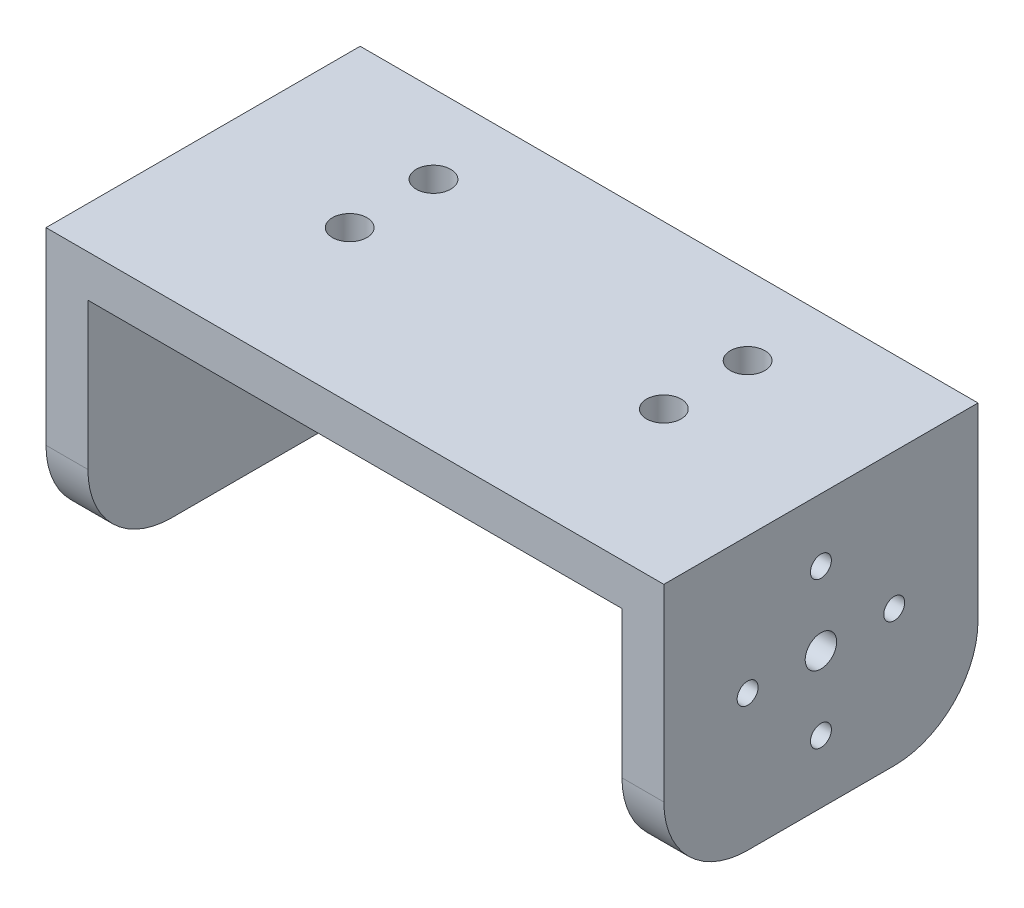
ISO-10303-21;
HEADER;
FILE_DESCRIPTION(('STEP AP214'),'2;1');
FILE_NAME('part.step','',(''),(''),'','','');
FILE_SCHEMA(('AUTOMOTIVE_DESIGN { 1 0 10303 214 1 1 1 1 }'));
ENDSEC;
DATA;
#1=APPLICATION_CONTEXT('core data for automotive mechanical design processes');
#2=APPLICATION_PROTOCOL_DEFINITION('international standard','automotive_design',2000,#1);
#3=PRODUCT_CONTEXT('',#1,'mechanical');
#4=PRODUCT('Part','Part','',(#3));
#5=PRODUCT_RELATED_PRODUCT_CATEGORY('part','',(#4));
#6=PRODUCT_DEFINITION_FORMATION('','',#4);
#7=PRODUCT_DEFINITION_CONTEXT('part definition',#1,'design');
#8=PRODUCT_DEFINITION('design','',#6,#7);
#9=PRODUCT_DEFINITION_SHAPE('','',#8);
#10=(LENGTH_UNIT() NAMED_UNIT(*) SI_UNIT(.MILLI.,.METRE.));
#11=(NAMED_UNIT(*) PLANE_ANGLE_UNIT() SI_UNIT($,.RADIAN.));
#12=(NAMED_UNIT(*) SI_UNIT($,.STERADIAN.) SOLID_ANGLE_UNIT());
#13=UNCERTAINTY_MEASURE_WITH_UNIT(LENGTH_MEASURE(1.E-05),#10,'distance_accuracy_value','');
#14=(GEOMETRIC_REPRESENTATION_CONTEXT(3) GLOBAL_UNCERTAINTY_ASSIGNED_CONTEXT((#13)) GLOBAL_UNIT_ASSIGNED_CONTEXT((#10,
#11,#12)) REPRESENTATION_CONTEXT('',''));
#15=CARTESIAN_POINT('',(0.,0.,0.));
#16=DIRECTION('',(0.,0.,1.));
#17=DIRECTION('',(1.,0.,0.));
#18=AXIS2_PLACEMENT_3D('',#15,#16,#17);
#19=CARTESIAN_POINT('',(29.5,0.,30.));
#20=DIRECTION('',(-1.,0.,0.));
#21=DIRECTION('',(0.,0.,1.));
#22=AXIS2_PLACEMENT_3D('',#19,#20,#21);
#23=PLANE('',#22);
#24=CARTESIAN_POINT('',(29.5,-13.,15.));
#25=DIRECTION('',(1.,0.,0.));
#26=DIRECTION('',(0.,0.,-1.));
#27=AXIS2_PLACEMENT_3D('',#24,#25,#26);
#28=CIRCLE('',#27,1.5);
#29=CARTESIAN_POINT('',(29.5,-13.,13.5));
#30=VERTEX_POINT('',#29);
#31=EDGE_CURVE('E513',#30,#30,#28,.T.);
#32=ORIENTED_EDGE('',*,*,#31,.F.);
#33=EDGE_LOOP('',(#32));
#34=FACE_BOUND('',#33,.T.);
#35=CARTESIAN_POINT('',(29.5,-13.,8.));
#36=DIRECTION('',(1.,0.,0.));
#37=DIRECTION('',(0.,0.,-1.));
#38=AXIS2_PLACEMENT_3D('',#35,#36,#37);
#39=CIRCLE('',#38,1.);
#40=CARTESIAN_POINT('',(29.5,-13.,7.));
#41=VERTEX_POINT('',#40);
#42=EDGE_CURVE('E212',#41,#41,#39,.T.);
#43=ORIENTED_EDGE('',*,*,#42,.F.);
#44=EDGE_LOOP('',(#43));
#45=FACE_BOUND('',#44,.T.);
#46=CARTESIAN_POINT('',(29.5,-20.,15.));
#47=DIRECTION('',(1.,0.,0.));
#48=DIRECTION('',(0.,0.,-1.));
#49=AXIS2_PLACEMENT_3D('',#46,#47,#48);
#50=CIRCLE('',#49,1.);
#51=CARTESIAN_POINT('',(29.5,-20.,14.));
#52=VERTEX_POINT('',#51);
#53=EDGE_CURVE('E521',#52,#52,#50,.T.);
#54=ORIENTED_EDGE('',*,*,#53,.F.);
#55=EDGE_LOOP('',(#54));
#56=FACE_BOUND('',#55,.T.);
#57=CARTESIAN_POINT('',(29.5,-13.,22.));
#58=DIRECTION('',(1.,0.,0.));
#59=DIRECTION('',(0.,0.,-1.));
#60=AXIS2_PLACEMENT_3D('',#57,#58,#59);
#61=CIRCLE('',#60,1.);
#62=CARTESIAN_POINT('',(29.5,-13.,21.));
#63=VERTEX_POINT('',#62);
#64=EDGE_CURVE('E516',#63,#63,#61,.T.);
#65=ORIENTED_EDGE('',*,*,#64,.F.);
#66=EDGE_LOOP('',(#65));
#67=FACE_BOUND('',#66,.T.);
#68=CARTESIAN_POINT('',(29.5,-6.00000000000001,15.));
#69=DIRECTION('',(1.,0.,0.));
#70=DIRECTION('',(0.,0.,-1.));
#71=AXIS2_PLACEMENT_3D('',#68,#69,#70);
#72=CIRCLE('',#71,1.);
#73=CARTESIAN_POINT('',(29.5,-6.00000000000001,14.));
#74=VERTEX_POINT('',#73);
#75=EDGE_CURVE('E227',#74,#74,#72,.T.);
#76=ORIENTED_EDGE('',*,*,#75,.F.);
#77=EDGE_LOOP('',(#76));
#78=FACE_BOUND('',#77,.T.);
#79=DIRECTION('',(0.,0.,-1.));
#80=VECTOR('',#79,1.);
#81=CARTESIAN_POINT('',(29.5,-26.,30.));
#82=LINE('',#81,#80);
#83=CARTESIAN_POINT('',(29.5,-26.,22.));
#84=VERTEX_POINT('',#83);
#85=CARTESIAN_POINT('',(29.5,-26.,8.));
#86=VERTEX_POINT('',#85);
#87=EDGE_CURVE('E246',#84,#86,#82,.T.);
#88=ORIENTED_EDGE('',*,*,#87,.T.);
#89=CARTESIAN_POINT('',(29.5,-18.,8.));
#90=DIRECTION('',(-1.,0.,0.));
#91=DIRECTION('',(0.,0.,1.));
#92=AXIS2_PLACEMENT_3D('',#89,#90,#91);
#93=CIRCLE('',#92,8.);
#94=CARTESIAN_POINT('',(29.5,-18.,0.));
#95=VERTEX_POINT('',#94);
#96=EDGE_CURVE('E187',#86,#95,#93,.F.);
#97=ORIENTED_EDGE('',*,*,#96,.T.);
#98=DIRECTION('',(0.,1.,0.));
#99=VECTOR('',#98,1.);
#100=CARTESIAN_POINT('',(29.5,0.,0.));
#101=LINE('',#100,#99);
#102=CARTESIAN_POINT('',(29.5,0.,0.));
#103=VERTEX_POINT('',#102);
#104=EDGE_CURVE('E153',#95,#103,#101,.T.);
#105=ORIENTED_EDGE('',*,*,#104,.T.);
#106=DIRECTION('',(0.,0.,-1.));
#107=VECTOR('',#106,1.);
#108=CARTESIAN_POINT('',(29.5,0.,30.));
#109=LINE('',#108,#107);
#110=CARTESIAN_POINT('',(29.5,0.,30.));
#111=VERTEX_POINT('',#110);
#112=EDGE_CURVE('E145',#111,#103,#109,.T.);
#113=ORIENTED_EDGE('',*,*,#112,.F.);
#114=DIRECTION('',(0.,1.,0.));
#115=VECTOR('',#114,1.);
#116=CARTESIAN_POINT('',(29.5,0.,30.));
#117=LINE('',#116,#115);
#118=CARTESIAN_POINT('',(29.5,-18.,30.));
#119=VERTEX_POINT('',#118);
#120=EDGE_CURVE('E129',#119,#111,#117,.T.);
#121=ORIENTED_EDGE('',*,*,#120,.F.);
#122=CARTESIAN_POINT('',(29.5,-18.,22.));
#123=DIRECTION('',(-1.,0.,0.));
#124=DIRECTION('',(0.,0.,1.));
#125=AXIS2_PLACEMENT_3D('',#122,#123,#124);
#126=CIRCLE('',#125,8.);
#127=EDGE_CURVE('E185',#119,#84,#126,.F.);
#128=ORIENTED_EDGE('',*,*,#127,.T.);
#129=EDGE_LOOP('',(#88,#97,#105,#113,#121,#128));
#130=FACE_BOUND('',#129,.T.);
#131=ADVANCED_FACE('F38',(#34,#45,#56,#67,#78,#130),#23,.F.);
#132=CARTESIAN_POINT('',(0.,0.,30.));
#133=DIRECTION('',(0.,-1.,0.));
#134=DIRECTION('',(1.,0.,0.));
#135=AXIS2_PLACEMENT_3D('',#132,#133,#134);
#136=PLANE('',#135);
#137=CARTESIAN_POINT('',(15.,0.,15.5));
#138=DIRECTION('',(0.,1.,0.));
#139=DIRECTION('',(1.,0.,0.));
#140=AXIS2_PLACEMENT_3D('',#137,#138,#139);
#141=CIRCLE('',#140,1.65000000000001);
#142=CARTESIAN_POINT('',(16.65,0.,15.5));
#143=VERTEX_POINT('',#142);
#144=EDGE_CURVE('E206',#143,#143,#141,.T.);
#145=ORIENTED_EDGE('',*,*,#144,.F.);
#146=EDGE_LOOP('',(#145));
#147=FACE_BOUND('',#146,.T.);
#148=CARTESIAN_POINT('',(-15.,0.,15.5));
#149=DIRECTION('',(0.,1.,0.));
#150=DIRECTION('',(1.,0.,0.));
#151=AXIS2_PLACEMENT_3D('',#148,#149,#150);
#152=CIRCLE('',#151,1.65);
#153=CARTESIAN_POINT('',(-13.35,0.,15.5));
#154=VERTEX_POINT('',#153);
#155=EDGE_CURVE('E232',#154,#154,#152,.T.);
#156=ORIENTED_EDGE('',*,*,#155,.F.);
#157=EDGE_LOOP('',(#156));
#158=FACE_BOUND('',#157,.T.);
#159=CARTESIAN_POINT('',(-15.,0.,7.5));
#160=DIRECTION('',(0.,1.,0.));
#161=DIRECTION('',(-1.,0.,0.));
#162=AXIS2_PLACEMENT_3D('',#159,#160,#161);
#163=CIRCLE('',#162,1.65);
#164=CARTESIAN_POINT('',(-16.65,0.,7.5));
#165=VERTEX_POINT('',#164);
#166=EDGE_CURVE('E229',#165,#165,#163,.T.);
#167=ORIENTED_EDGE('',*,*,#166,.F.);
#168=EDGE_LOOP('',(#167));
#169=FACE_BOUND('',#168,.T.);
#170=CARTESIAN_POINT('',(15.,0.,7.5));
#171=DIRECTION('',(0.,1.,0.));
#172=DIRECTION('',(-1.,0.,0.));
#173=AXIS2_PLACEMENT_3D('',#170,#171,#172);
#174=CIRCLE('',#173,1.65000000000001);
#175=CARTESIAN_POINT('',(13.35,0.,7.5));
#176=VERTEX_POINT('',#175);
#177=EDGE_CURVE('E194',#176,#176,#174,.T.);
#178=ORIENTED_EDGE('',*,*,#177,.F.);
#179=EDGE_LOOP('',(#178));
#180=FACE_BOUND('',#179,.T.);
#181=DIRECTION('',(-1.,0.,0.));
#182=VECTOR('',#181,1.);
#183=CARTESIAN_POINT('',(0.,0.,0.));
#184=LINE('',#183,#182);
#185=CARTESIAN_POINT('',(-29.5,0.,0.));
#186=VERTEX_POINT('',#185);
#187=EDGE_CURVE('E248',#103,#186,#184,.T.);
#188=ORIENTED_EDGE('',*,*,#187,.T.);
#189=DIRECTION('',(0.,0.,-1.));
#190=VECTOR('',#189,1.);
#191=CARTESIAN_POINT('',(-29.5,0.,30.));
#192=LINE('',#191,#190);
#193=CARTESIAN_POINT('',(-29.5,0.,30.));
#194=VERTEX_POINT('',#193);
#195=EDGE_CURVE('E147',#194,#186,#192,.T.);
#196=ORIENTED_EDGE('',*,*,#195,.F.);
#197=DIRECTION('',(-1.,0.,0.));
#198=VECTOR('',#197,1.);
#199=CARTESIAN_POINT('',(0.,0.,30.));
#200=LINE('',#199,#198);
#201=EDGE_CURVE('E133',#111,#194,#200,.T.);
#202=ORIENTED_EDGE('',*,*,#201,.F.);
#203=ORIENTED_EDGE('',*,*,#112,.T.);
#204=EDGE_LOOP('',(#188,#196,#202,#203));
#205=FACE_BOUND('',#204,.T.);
#206=ADVANCED_FACE('F144',(#147,#158,#169,#180,#205),#136,.F.);
#207=CARTESIAN_POINT('',(-29.5,0.,30.));
#208=DIRECTION('',(1.,0.,0.));
#209=DIRECTION('',(0.,1.,0.));
#210=AXIS2_PLACEMENT_3D('',#207,#208,#209);
#211=PLANE('',#210);
#212=CARTESIAN_POINT('',(-29.5,-13.,15.));
#213=DIRECTION('',(-1.,0.,0.));
#214=DIRECTION('',(0.,-1.,0.));
#215=AXIS2_PLACEMENT_3D('',#212,#213,#214);
#216=CIRCLE('',#215,1.65);
#217=CARTESIAN_POINT('',(-29.5,-14.65,15.));
#218=VERTEX_POINT('',#217);
#219=EDGE_CURVE('E207',#218,#218,#216,.T.);
#220=ORIENTED_EDGE('',*,*,#219,.F.);
#221=EDGE_LOOP('',(#220));
#222=FACE_BOUND('',#221,.T.);
#223=DIRECTION('',(0.,0.,-1.));
#224=VECTOR('',#223,1.);
#225=CARTESIAN_POINT('',(-29.5,-26.,30.));
#226=LINE('',#225,#224);
#227=CARTESIAN_POINT('',(-29.5,-26.,22.));
#228=VERTEX_POINT('',#227);
#229=CARTESIAN_POINT('',(-29.5,-26.,8.));
#230=VERTEX_POINT('',#229);
#231=EDGE_CURVE('E158',#228,#230,#226,.T.);
#232=ORIENTED_EDGE('',*,*,#231,.F.);
#233=CARTESIAN_POINT('',(-29.5,-18.,22.));
#234=DIRECTION('',(1.,0.,0.));
#235=DIRECTION('',(0.,1.,0.));
#236=AXIS2_PLACEMENT_3D('',#233,#234,#235);
#237=CIRCLE('',#236,8.);
#238=CARTESIAN_POINT('',(-29.5,-18.,30.));
#239=VERTEX_POINT('',#238);
#240=EDGE_CURVE('E175',#228,#239,#237,.F.);
#241=ORIENTED_EDGE('',*,*,#240,.T.);
#242=DIRECTION('',(0.,-1.,0.));
#243=VECTOR('',#242,1.);
#244=CARTESIAN_POINT('',(-29.5,0.,30.));
#245=LINE('',#244,#243);
#246=EDGE_CURVE('E149',#194,#239,#245,.T.);
#247=ORIENTED_EDGE('',*,*,#246,.F.);
#248=ORIENTED_EDGE('',*,*,#195,.T.);
#249=DIRECTION('',(0.,-1.,0.));
#250=VECTOR('',#249,1.);
#251=CARTESIAN_POINT('',(-29.5,0.,0.));
#252=LINE('',#251,#250);
#253=CARTESIAN_POINT('',(-29.5,-18.,0.));
#254=VERTEX_POINT('',#253);
#255=EDGE_CURVE('E250',#186,#254,#252,.T.);
#256=ORIENTED_EDGE('',*,*,#255,.T.);
#257=CARTESIAN_POINT('',(-29.5,-18.,8.));
#258=DIRECTION('',(1.,0.,0.));
#259=DIRECTION('',(0.,1.,0.));
#260=AXIS2_PLACEMENT_3D('',#257,#258,#259);
#261=CIRCLE('',#260,8.);
#262=EDGE_CURVE('E173',#254,#230,#261,.F.);
#263=ORIENTED_EDGE('',*,*,#262,.T.);
#264=EDGE_LOOP('',(#232,#241,#247,#248,#256,#263));
#265=FACE_BOUND('',#264,.T.);
#266=ADVANCED_FACE('F299',(#222,#265),#211,.F.);
#267=CARTESIAN_POINT('',(-25.5,-26.,30.));
#268=DIRECTION('',(0.,1.,0.));
#269=DIRECTION('',(0.,0.,1.));
#270=AXIS2_PLACEMENT_3D('',#267,#268,#269);
#271=PLANE('',#270);
#272=DIRECTION('',(0.,0.,-1.));
#273=VECTOR('',#272,1.);
#274=CARTESIAN_POINT('',(-25.5,-26.,30.));
#275=LINE('',#274,#273);
#276=CARTESIAN_POINT('',(-25.5,-26.,22.));
#277=VERTEX_POINT('',#276);
#278=CARTESIAN_POINT('',(-25.5,-26.,8.));
#279=VERTEX_POINT('',#278);
#280=EDGE_CURVE('E267',#277,#279,#275,.T.);
#281=ORIENTED_EDGE('',*,*,#280,.F.);
#282=DIRECTION('',(1.,0.,0.));
#283=VECTOR('',#282,1.);
#284=CARTESIAN_POINT('',(-29.5,-26.,22.));
#285=LINE('',#284,#283);
#286=EDGE_CURVE('E171',#277,#228,#285,.F.);
#287=ORIENTED_EDGE('',*,*,#286,.T.);
#288=ORIENTED_EDGE('',*,*,#231,.T.);
#289=DIRECTION('',(1.,0.,0.));
#290=VECTOR('',#289,1.);
#291=CARTESIAN_POINT('',(-25.5,-26.,8.));
#292=LINE('',#291,#290);
#293=EDGE_CURVE('E168',#230,#279,#292,.T.);
#294=ORIENTED_EDGE('',*,*,#293,.T.);
#295=EDGE_LOOP('',(#281,#287,#288,#294));
#296=FACE_BOUND('',#295,.T.);
#297=ADVANCED_FACE('F274',(#296),#271,.F.);
#298=CARTESIAN_POINT('',(-25.5,-4.00000000000001,30.));
#299=DIRECTION('',(-1.,0.,0.));
#300=DIRECTION('',(0.,0.,1.));
#301=AXIS2_PLACEMENT_3D('',#298,#299,#300);
#302=PLANE('',#301);
#303=CARTESIAN_POINT('',(-25.5,-13.,15.));
#304=DIRECTION('',(-1.,0.,0.));
#305=DIRECTION('',(0.,0.,1.));
#306=AXIS2_PLACEMENT_3D('',#303,#304,#305);
#307=CIRCLE('',#306,1.65);
#308=CARTESIAN_POINT('',(-25.5,-13.,16.65));
#309=VERTEX_POINT('',#308);
#310=EDGE_CURVE('E203',#309,#309,#307,.T.);
#311=ORIENTED_EDGE('',*,*,#310,.T.);
#312=EDGE_LOOP('',(#311));
#313=FACE_BOUND('',#312,.T.);
#314=DIRECTION('',(0.,1.,0.));
#315=VECTOR('',#314,1.);
#316=CARTESIAN_POINT('',(-25.5,-4.00000000000001,30.));
#317=LINE('',#316,#315);
#318=CARTESIAN_POINT('',(-25.5,-18.,30.));
#319=VERTEX_POINT('',#318);
#320=CARTESIAN_POINT('',(-25.5,-4.00000000000001,30.));
#321=VERTEX_POINT('',#320);
#322=EDGE_CURVE('E240',#319,#321,#317,.T.);
#323=ORIENTED_EDGE('',*,*,#322,.F.);
#324=CARTESIAN_POINT('',(-25.5,-18.,22.));
#325=DIRECTION('',(-1.,0.,0.));
#326=DIRECTION('',(0.,0.,1.));
#327=AXIS2_PLACEMENT_3D('',#324,#325,#326);
#328=CIRCLE('',#327,8.);
#329=EDGE_CURVE('E166',#319,#277,#328,.F.);
#330=ORIENTED_EDGE('',*,*,#329,.T.);
#331=ORIENTED_EDGE('',*,*,#280,.T.);
#332=CARTESIAN_POINT('',(-25.5,-18.,8.));
#333=DIRECTION('',(-1.,0.,0.));
#334=DIRECTION('',(0.,0.,1.));
#335=AXIS2_PLACEMENT_3D('',#332,#333,#334);
#336=CIRCLE('',#335,8.);
#337=CARTESIAN_POINT('',(-25.5,-18.,0.));
#338=VERTEX_POINT('',#337);
#339=EDGE_CURVE('E164',#279,#338,#336,.F.);
#340=ORIENTED_EDGE('',*,*,#339,.T.);
#341=DIRECTION('',(0.,1.,0.));
#342=VECTOR('',#341,1.);
#343=CARTESIAN_POINT('',(-25.5,-4.00000000000001,0.));
#344=LINE('',#343,#342);
#345=CARTESIAN_POINT('',(-25.5,-4.00000000000001,0.));
#346=VERTEX_POINT('',#345);
#347=EDGE_CURVE('E253',#338,#346,#344,.T.);
#348=ORIENTED_EDGE('',*,*,#347,.T.);
#349=DIRECTION('',(0.,0.,-1.));
#350=VECTOR('',#349,1.);
#351=CARTESIAN_POINT('',(-25.5,-4.00000000000001,30.));
#352=LINE('',#351,#350);
#353=EDGE_CURVE('E264',#321,#346,#352,.T.);
#354=ORIENTED_EDGE('',*,*,#353,.F.);
#355=EDGE_LOOP('',(#323,#330,#331,#340,#348,#354));
#356=FACE_BOUND('',#355,.T.);
#357=ADVANCED_FACE('F285',(#313,#356),#302,.F.);
#358=CARTESIAN_POINT('',(0.,-4.,30.));
#359=DIRECTION('',(0.,1.,0.));
#360=DIRECTION('',(0.,0.,1.));
#361=AXIS2_PLACEMENT_3D('',#358,#359,#360);
#362=PLANE('',#361);
#363=CARTESIAN_POINT('',(15.,-4.,15.5));
#364=DIRECTION('',(0.,1.,0.));
#365=DIRECTION('',(0.,0.,1.));
#366=AXIS2_PLACEMENT_3D('',#363,#364,#365);
#367=CIRCLE('',#366,1.65000000000001);
#368=CARTESIAN_POINT('',(15.,-4.,17.15));
#369=VERTEX_POINT('',#368);
#370=EDGE_CURVE('E200',#369,#369,#367,.T.);
#371=ORIENTED_EDGE('',*,*,#370,.T.);
#372=EDGE_LOOP('',(#371));
#373=FACE_BOUND('',#372,.T.);
#374=CARTESIAN_POINT('',(-15.,-4.,15.5));
#375=DIRECTION('',(0.,1.,0.));
#376=DIRECTION('',(0.,0.,1.));
#377=AXIS2_PLACEMENT_3D('',#374,#375,#376);
#378=CIRCLE('',#377,1.65);
#379=CARTESIAN_POINT('',(-15.,-4.,17.15));
#380=VERTEX_POINT('',#379);
#381=EDGE_CURVE('E197',#380,#380,#378,.T.);
#382=ORIENTED_EDGE('',*,*,#381,.T.);
#383=EDGE_LOOP('',(#382));
#384=FACE_BOUND('',#383,.T.);
#385=CARTESIAN_POINT('',(-15.,-4.,7.5));
#386=DIRECTION('',(0.,1.,0.));
#387=DIRECTION('',(0.,0.,1.));
#388=AXIS2_PLACEMENT_3D('',#385,#386,#387);
#389=CIRCLE('',#388,1.65);
#390=CARTESIAN_POINT('',(-15.,-4.,9.15));
#391=VERTEX_POINT('',#390);
#392=EDGE_CURVE('E193',#391,#391,#389,.T.);
#393=ORIENTED_EDGE('',*,*,#392,.T.);
#394=EDGE_LOOP('',(#393));
#395=FACE_BOUND('',#394,.T.);
#396=CARTESIAN_POINT('',(15.,-4.,7.5));
#397=DIRECTION('',(0.,1.,0.));
#398=DIRECTION('',(0.,0.,1.));
#399=AXIS2_PLACEMENT_3D('',#396,#397,#398);
#400=CIRCLE('',#399,1.65000000000001);
#401=CARTESIAN_POINT('',(15.,-4.,9.15));
#402=VERTEX_POINT('',#401);
#403=EDGE_CURVE('E190',#402,#402,#400,.T.);
#404=ORIENTED_EDGE('',*,*,#403,.T.);
#405=EDGE_LOOP('',(#404));
#406=FACE_BOUND('',#405,.T.);
#407=DIRECTION('',(1.,0.,0.));
#408=VECTOR('',#407,1.);
#409=CARTESIAN_POINT('',(0.,-4.,0.));
#410=LINE('',#409,#408);
#411=CARTESIAN_POINT('',(25.5,-4.,0.));
#412=VERTEX_POINT('',#411);
#413=EDGE_CURVE('E255',#346,#412,#410,.T.);
#414=ORIENTED_EDGE('',*,*,#413,.T.);
#415=DIRECTION('',(0.,0.,-1.));
#416=VECTOR('',#415,1.);
#417=CARTESIAN_POINT('',(25.5,-4.,30.));
#418=LINE('',#417,#416);
#419=CARTESIAN_POINT('',(25.5,-4.,30.));
#420=VERTEX_POINT('',#419);
#421=EDGE_CURVE('E261',#420,#412,#418,.T.);
#422=ORIENTED_EDGE('',*,*,#421,.F.);
#423=DIRECTION('',(1.,0.,0.));
#424=VECTOR('',#423,1.);
#425=CARTESIAN_POINT('',(0.,-4.,30.));
#426=LINE('',#425,#424);
#427=EDGE_CURVE('E242',#321,#420,#426,.T.);
#428=ORIENTED_EDGE('',*,*,#427,.F.);
#429=ORIENTED_EDGE('',*,*,#353,.T.);
#430=EDGE_LOOP('',(#414,#422,#428,#429));
#431=FACE_BOUND('',#430,.T.);
#432=ADVANCED_FACE('F295',(#373,#384,#395,#406,#431),#362,.F.);
#433=CARTESIAN_POINT('',(25.5,-4.,30.));
#434=DIRECTION('',(1.,0.,0.));
#435=DIRECTION('',(0.,1.,0.));
#436=AXIS2_PLACEMENT_3D('',#433,#434,#435);
#437=PLANE('',#436);
#438=CARTESIAN_POINT('',(25.5,-13.,15.));
#439=DIRECTION('',(1.,0.,0.));
#440=DIRECTION('',(0.,1.,0.));
#441=AXIS2_PLACEMENT_3D('',#438,#439,#440);
#442=CIRCLE('',#441,1.5);
#443=CARTESIAN_POINT('',(25.5,-11.5,15.));
#444=VERTEX_POINT('',#443);
#445=EDGE_CURVE('E42',#444,#444,#442,.T.);
#446=ORIENTED_EDGE('',*,*,#445,.T.);
#447=EDGE_LOOP('',(#446));
#448=FACE_BOUND('',#447,.T.);
#449=CARTESIAN_POINT('',(25.5,-13.,8.));
#450=DIRECTION('',(1.,0.,0.));
#451=DIRECTION('',(0.,1.,0.));
#452=AXIS2_PLACEMENT_3D('',#449,#450,#451);
#453=CIRCLE('',#452,1.);
#454=CARTESIAN_POINT('',(25.5,-12.,8.));
#455=VERTEX_POINT('',#454);
#456=EDGE_CURVE('E217',#455,#455,#453,.T.);
#457=ORIENTED_EDGE('',*,*,#456,.T.);
#458=EDGE_LOOP('',(#457));
#459=FACE_BOUND('',#458,.T.);
#460=CARTESIAN_POINT('',(25.5,-20.,15.));
#461=DIRECTION('',(1.,0.,0.));
#462=DIRECTION('',(0.,1.,0.));
#463=AXIS2_PLACEMENT_3D('',#460,#461,#462);
#464=CIRCLE('',#463,1.);
#465=CARTESIAN_POINT('',(25.5,-19.,15.));
#466=VERTEX_POINT('',#465);
#467=EDGE_CURVE('E215',#466,#466,#464,.T.);
#468=ORIENTED_EDGE('',*,*,#467,.T.);
#469=EDGE_LOOP('',(#468));
#470=FACE_BOUND('',#469,.T.);
#471=CARTESIAN_POINT('',(25.5,-13.,22.));
#472=DIRECTION('',(1.,0.,0.));
#473=DIRECTION('',(0.,1.,0.));
#474=AXIS2_PLACEMENT_3D('',#471,#472,#473);
#475=CIRCLE('',#474,1.);
#476=CARTESIAN_POINT('',(25.5,-12.,22.));
#477=VERTEX_POINT('',#476);
#478=EDGE_CURVE('E211',#477,#477,#475,.T.);
#479=ORIENTED_EDGE('',*,*,#478,.T.);
#480=EDGE_LOOP('',(#479));
#481=FACE_BOUND('',#480,.T.);
#482=CARTESIAN_POINT('',(25.5,-6.00000000000001,15.));
#483=DIRECTION('',(1.,0.,0.));
#484=DIRECTION('',(0.,1.,0.));
#485=AXIS2_PLACEMENT_3D('',#482,#483,#484);
#486=CIRCLE('',#485,1.);
#487=CARTESIAN_POINT('',(25.5,-5.,15.));
#488=VERTEX_POINT('',#487);
#489=EDGE_CURVE('E208',#488,#488,#486,.T.);
#490=ORIENTED_EDGE('',*,*,#489,.T.);
#491=EDGE_LOOP('',(#490));
#492=FACE_BOUND('',#491,.T.);
#493=DIRECTION('',(0.,-1.,0.));
#494=VECTOR('',#493,1.);
#495=CARTESIAN_POINT('',(25.5,-4.,0.));
#496=LINE('',#495,#494);
#497=CARTESIAN_POINT('',(25.5,-18.,0.));
#498=VERTEX_POINT('',#497);
#499=EDGE_CURVE('E140',#412,#498,#496,.T.);
#500=ORIENTED_EDGE('',*,*,#499,.T.);
#501=CARTESIAN_POINT('',(25.5,-18.,8.));
#502=DIRECTION('',(1.,0.,0.));
#503=DIRECTION('',(0.,1.,0.));
#504=AXIS2_PLACEMENT_3D('',#501,#502,#503);
#505=CIRCLE('',#504,8.);
#506=CARTESIAN_POINT('',(25.5,-26.,8.));
#507=VERTEX_POINT('',#506);
#508=EDGE_CURVE('E11',#498,#507,#505,.F.);
#509=ORIENTED_EDGE('',*,*,#508,.T.);
#510=DIRECTION('',(0.,0.,-1.));
#511=VECTOR('',#510,1.);
#512=CARTESIAN_POINT('',(25.5,-26.,30.));
#513=LINE('',#512,#511);
#514=CARTESIAN_POINT('',(25.5,-26.,22.));
#515=VERTEX_POINT('',#514);
#516=EDGE_CURVE('E259',#515,#507,#513,.T.);
#517=ORIENTED_EDGE('',*,*,#516,.F.);
#518=CARTESIAN_POINT('',(25.5,-18.,22.));
#519=DIRECTION('',(1.,0.,0.));
#520=DIRECTION('',(0.,1.,0.));
#521=AXIS2_PLACEMENT_3D('',#518,#519,#520);
#522=CIRCLE('',#521,8.);
#523=CARTESIAN_POINT('',(25.5,-18.,30.));
#524=VERTEX_POINT('',#523);
#525=EDGE_CURVE('E47',#515,#524,#522,.F.);
#526=ORIENTED_EDGE('',*,*,#525,.T.);
#527=DIRECTION('',(0.,-1.,0.));
#528=VECTOR('',#527,1.);
#529=CARTESIAN_POINT('',(25.5,-4.,30.));
#530=LINE('',#529,#528);
#531=EDGE_CURVE('E244',#420,#524,#530,.T.);
#532=ORIENTED_EDGE('',*,*,#531,.F.);
#533=ORIENTED_EDGE('',*,*,#421,.T.);
#534=EDGE_LOOP('',(#500,#509,#517,#526,#532,#533));
#535=FACE_BOUND('',#534,.T.);
#536=ADVANCED_FACE('F308',(#448,#459,#470,#481,#492,#535),#437,.F.);
#537=CARTESIAN_POINT('',(25.5,-26.,30.));
#538=DIRECTION('',(0.,1.,0.));
#539=DIRECTION('',(0.,0.,1.));
#540=AXIS2_PLACEMENT_3D('',#537,#538,#539);
#541=PLANE('',#540);
#542=ORIENTED_EDGE('',*,*,#516,.T.);
#543=DIRECTION('',(1.,0.,0.));
#544=VECTOR('',#543,1.);
#545=CARTESIAN_POINT('',(25.5,-26.,8.));
#546=LINE('',#545,#544);
#547=EDGE_CURVE('E182',#507,#86,#546,.T.);
#548=ORIENTED_EDGE('',*,*,#547,.T.);
#549=ORIENTED_EDGE('',*,*,#87,.F.);
#550=DIRECTION('',(1.,0.,0.));
#551=VECTOR('',#550,1.);
#552=CARTESIAN_POINT('',(25.5,-26.,22.));
#553=LINE('',#552,#551);
#554=EDGE_CURVE('E60',#84,#515,#553,.F.);
#555=ORIENTED_EDGE('',*,*,#554,.T.);
#556=EDGE_LOOP('',(#542,#548,#549,#555));
#557=FACE_BOUND('',#556,.T.);
#558=ADVANCED_FACE('F304',(#557),#541,.F.);
#559=CARTESIAN_POINT('',(0.,0.,30.));
#560=DIRECTION('',(0.,0.,1.));
#561=DIRECTION('',(1.,0.,0.));
#562=AXIS2_PLACEMENT_3D('',#559,#560,#561);
#563=PLANE('',#562);
#564=ORIENTED_EDGE('',*,*,#246,.T.);
#565=DIRECTION('',(1.,0.,0.));
#566=VECTOR('',#565,1.);
#567=CARTESIAN_POINT('',(-25.5,-18.,30.));
#568=LINE('',#567,#566);
#569=EDGE_CURVE('E156',#239,#319,#568,.T.);
#570=ORIENTED_EDGE('',*,*,#569,.T.);
#571=ORIENTED_EDGE('',*,*,#322,.T.);
#572=ORIENTED_EDGE('',*,*,#427,.T.);
#573=ORIENTED_EDGE('',*,*,#531,.T.);
#574=DIRECTION('',(1.,0.,0.));
#575=VECTOR('',#574,1.);
#576=CARTESIAN_POINT('',(29.5,-18.,30.));
#577=LINE('',#576,#575);
#578=EDGE_CURVE('E137',#524,#119,#577,.T.);
#579=ORIENTED_EDGE('',*,*,#578,.T.);
#580=ORIENTED_EDGE('',*,*,#120,.T.);
#581=ORIENTED_EDGE('',*,*,#201,.T.);
#582=EDGE_LOOP('',(#564,#570,#571,#572,#573,#579,#580,#581));
#583=FACE_BOUND('',#582,.T.);
#584=ADVANCED_FACE('F132',(#583),#563,.T.);
#585=CARTESIAN_POINT('',(0.,0.,0.));
#586=DIRECTION('',(0.,0.,1.));
#587=DIRECTION('',(1.,0.,0.));
#588=AXIS2_PLACEMENT_3D('',#585,#586,#587);
#589=PLANE('',#588);
#590=ORIENTED_EDGE('',*,*,#347,.F.);
#591=DIRECTION('',(1.,0.,0.));
#592=VECTOR('',#591,1.);
#593=CARTESIAN_POINT('',(0.,-18.,0.));
#594=LINE('',#593,#592);
#595=EDGE_CURVE('E179',#338,#254,#594,.F.);
#596=ORIENTED_EDGE('',*,*,#595,.T.);
#597=ORIENTED_EDGE('',*,*,#255,.F.);
#598=ORIENTED_EDGE('',*,*,#187,.F.);
#599=ORIENTED_EDGE('',*,*,#104,.F.);
#600=DIRECTION('',(1.,0.,0.));
#601=VECTOR('',#600,1.);
#602=CARTESIAN_POINT('',(0.,-18.,0.));
#603=LINE('',#602,#601);
#604=EDGE_CURVE('E177',#95,#498,#603,.F.);
#605=ORIENTED_EDGE('',*,*,#604,.T.);
#606=ORIENTED_EDGE('',*,*,#499,.F.);
#607=ORIENTED_EDGE('',*,*,#413,.F.);
#608=EDGE_LOOP('',(#590,#596,#597,#598,#599,#605,#606,#607));
#609=FACE_BOUND('',#608,.T.);
#610=ADVANCED_FACE('F289',(#609),#589,.F.);
#611=CARTESIAN_POINT('',(0.,-18.,22.));
#612=DIRECTION('',(-1.,0.,0.));
#613=DIRECTION('',(0.,0.,1.));
#614=AXIS2_PLACEMENT_3D('',#611,#612,#613);
#615=CYLINDRICAL_SURFACE('',#614,8.);
#616=ORIENTED_EDGE('',*,*,#240,.F.);
#617=ORIENTED_EDGE('',*,*,#286,.F.);
#618=ORIENTED_EDGE('',*,*,#329,.F.);
#619=ORIENTED_EDGE('',*,*,#569,.F.);
#620=EDGE_LOOP('',(#616,#617,#618,#619));
#621=FACE_BOUND('',#620,.T.);
#622=ADVANCED_FACE('F298',(#621),#615,.T.);
#623=CARTESIAN_POINT('',(-25.5,-18.,8.));
#624=DIRECTION('',(1.,0.,0.));
#625=DIRECTION('',(0.,0.,-1.));
#626=AXIS2_PLACEMENT_3D('',#623,#624,#625);
#627=CYLINDRICAL_SURFACE('',#626,8.);
#628=ORIENTED_EDGE('',*,*,#262,.F.);
#629=ORIENTED_EDGE('',*,*,#595,.F.);
#630=ORIENTED_EDGE('',*,*,#339,.F.);
#631=ORIENTED_EDGE('',*,*,#293,.F.);
#632=EDGE_LOOP('',(#628,#629,#630,#631));
#633=FACE_BOUND('',#632,.T.);
#634=ADVANCED_FACE('F280',(#633),#627,.T.);
#635=CARTESIAN_POINT('',(25.5,-18.,8.));
#636=DIRECTION('',(1.,0.,0.));
#637=DIRECTION('',(0.,0.,-1.));
#638=AXIS2_PLACEMENT_3D('',#635,#636,#637);
#639=CYLINDRICAL_SURFACE('',#638,8.);
#640=ORIENTED_EDGE('',*,*,#508,.F.);
#641=ORIENTED_EDGE('',*,*,#604,.F.);
#642=ORIENTED_EDGE('',*,*,#96,.F.);
#643=ORIENTED_EDGE('',*,*,#547,.F.);
#644=EDGE_LOOP('',(#640,#641,#642,#643));
#645=FACE_BOUND('',#644,.T.);
#646=ADVANCED_FACE('F302',(#645),#639,.T.);
#647=CARTESIAN_POINT('',(0.,-18.,22.));
#648=DIRECTION('',(-1.,0.,0.));
#649=DIRECTION('',(0.,0.,1.));
#650=AXIS2_PLACEMENT_3D('',#647,#648,#649);
#651=CYLINDRICAL_SURFACE('',#650,8.);
#652=ORIENTED_EDGE('',*,*,#525,.F.);
#653=ORIENTED_EDGE('',*,*,#554,.F.);
#654=ORIENTED_EDGE('',*,*,#127,.F.);
#655=ORIENTED_EDGE('',*,*,#578,.F.);
#656=EDGE_LOOP('',(#652,#653,#654,#655));
#657=FACE_BOUND('',#656,.T.);
#658=ADVANCED_FACE('F40',(#657),#651,.T.);
#659=CARTESIAN_POINT('',(15.,-10.,7.5));
#660=DIRECTION('',(0.,1.,0.));
#661=DIRECTION('',(-1.,0.,0.));
#662=AXIS2_PLACEMENT_3D('',#659,#660,#661);
#663=CYLINDRICAL_SURFACE('',#662,1.65000000000001);
#664=ORIENTED_EDGE('',*,*,#177,.T.);
#665=EDGE_LOOP('',(#664));
#666=FACE_BOUND('',#665,.T.);
#667=ORIENTED_EDGE('',*,*,#403,.F.);
#668=EDGE_LOOP('',(#667));
#669=FACE_BOUND('',#668,.T.);
#670=ADVANCED_FACE('F339',(#666,#669),#663,.F.);
#671=CARTESIAN_POINT('',(-15.,-10.,7.5));
#672=DIRECTION('',(0.,1.,0.));
#673=DIRECTION('',(-1.,0.,0.));
#674=AXIS2_PLACEMENT_3D('',#671,#672,#673);
#675=CYLINDRICAL_SURFACE('',#674,1.65);
#676=ORIENTED_EDGE('',*,*,#166,.T.);
#677=EDGE_LOOP('',(#676));
#678=FACE_BOUND('',#677,.T.);
#679=ORIENTED_EDGE('',*,*,#392,.F.);
#680=EDGE_LOOP('',(#679));
#681=FACE_BOUND('',#680,.T.);
#682=ADVANCED_FACE('F343',(#678,#681),#675,.F.);
#683=CARTESIAN_POINT('',(-15.,-10.,15.5));
#684=DIRECTION('',(0.,1.,0.));
#685=DIRECTION('',(-1.,0.,0.));
#686=AXIS2_PLACEMENT_3D('',#683,#684,#685);
#687=CYLINDRICAL_SURFACE('',#686,1.65);
#688=ORIENTED_EDGE('',*,*,#155,.T.);
#689=EDGE_LOOP('',(#688));
#690=FACE_BOUND('',#689,.T.);
#691=ORIENTED_EDGE('',*,*,#381,.F.);
#692=EDGE_LOOP('',(#691));
#693=FACE_BOUND('',#692,.T.);
#694=ADVANCED_FACE('F349',(#690,#693),#687,.F.);
#695=CARTESIAN_POINT('',(15.,-10.,15.5));
#696=DIRECTION('',(0.,1.,0.));
#697=DIRECTION('',(-1.,0.,0.));
#698=AXIS2_PLACEMENT_3D('',#695,#696,#697);
#699=CYLINDRICAL_SURFACE('',#698,1.65000000000001);
#700=ORIENTED_EDGE('',*,*,#144,.T.);
#701=EDGE_LOOP('',(#700));
#702=FACE_BOUND('',#701,.T.);
#703=ORIENTED_EDGE('',*,*,#370,.F.);
#704=EDGE_LOOP('',(#703));
#705=FACE_BOUND('',#704,.T.);
#706=ADVANCED_FACE('F355',(#702,#705),#699,.F.);
#707=CARTESIAN_POINT('',(-19.5,-13.,15.));
#708=DIRECTION('',(-1.,0.,0.));
#709=DIRECTION('',(0.,-1.,0.));
#710=AXIS2_PLACEMENT_3D('',#707,#708,#709);
#711=CYLINDRICAL_SURFACE('',#710,1.65);
#712=ORIENTED_EDGE('',*,*,#219,.T.);
#713=EDGE_LOOP('',(#712));
#714=FACE_BOUND('',#713,.T.);
#715=ORIENTED_EDGE('',*,*,#310,.F.);
#716=EDGE_LOOP('',(#715));
#717=FACE_BOUND('',#716,.T.);
#718=ADVANCED_FACE('F425',(#714,#717),#711,.F.);
#719=CARTESIAN_POINT('',(19.5,-6.00000000000001,15.));
#720=DIRECTION('',(1.,0.,0.));
#721=DIRECTION('',(0.,0.,-1.));
#722=AXIS2_PLACEMENT_3D('',#719,#720,#721);
#723=CYLINDRICAL_SURFACE('',#722,1.);
#724=ORIENTED_EDGE('',*,*,#75,.T.);
#725=EDGE_LOOP('',(#724));
#726=FACE_BOUND('',#725,.T.);
#727=ORIENTED_EDGE('',*,*,#489,.F.);
#728=EDGE_LOOP('',(#727));
#729=FACE_BOUND('',#728,.T.);
#730=ADVANCED_FACE('F450',(#726,#729),#723,.F.);
#731=CARTESIAN_POINT('',(19.5,-13.,22.));
#732=DIRECTION('',(1.,0.,0.));
#733=DIRECTION('',(0.,0.,-1.));
#734=AXIS2_PLACEMENT_3D('',#731,#732,#733);
#735=CYLINDRICAL_SURFACE('',#734,1.);
#736=ORIENTED_EDGE('',*,*,#64,.T.);
#737=EDGE_LOOP('',(#736));
#738=FACE_BOUND('',#737,.T.);
#739=ORIENTED_EDGE('',*,*,#478,.F.);
#740=EDGE_LOOP('',(#739));
#741=FACE_BOUND('',#740,.T.);
#742=ADVANCED_FACE('F459',(#738,#741),#735,.F.);
#743=CARTESIAN_POINT('',(19.5,-20.,15.));
#744=DIRECTION('',(1.,0.,0.));
#745=DIRECTION('',(0.,0.,-1.));
#746=AXIS2_PLACEMENT_3D('',#743,#744,#745);
#747=CYLINDRICAL_SURFACE('',#746,1.);
#748=ORIENTED_EDGE('',*,*,#53,.T.);
#749=EDGE_LOOP('',(#748));
#750=FACE_BOUND('',#749,.T.);
#751=ORIENTED_EDGE('',*,*,#467,.F.);
#752=EDGE_LOOP('',(#751));
#753=FACE_BOUND('',#752,.T.);
#754=ADVANCED_FACE('F469',(#750,#753),#747,.F.);
#755=CARTESIAN_POINT('',(19.5,-13.,8.));
#756=DIRECTION('',(1.,0.,0.));
#757=DIRECTION('',(0.,0.,-1.));
#758=AXIS2_PLACEMENT_3D('',#755,#756,#757);
#759=CYLINDRICAL_SURFACE('',#758,1.);
#760=ORIENTED_EDGE('',*,*,#42,.T.);
#761=EDGE_LOOP('',(#760));
#762=FACE_BOUND('',#761,.T.);
#763=ORIENTED_EDGE('',*,*,#456,.F.);
#764=EDGE_LOOP('',(#763));
#765=FACE_BOUND('',#764,.T.);
#766=ADVANCED_FACE('F479',(#762,#765),#759,.F.);
#767=CARTESIAN_POINT('',(19.5,-13.,15.));
#768=DIRECTION('',(1.,0.,0.));
#769=DIRECTION('',(0.,0.,-1.));
#770=AXIS2_PLACEMENT_3D('',#767,#768,#769);
#771=CYLINDRICAL_SURFACE('',#770,1.5);
#772=ORIENTED_EDGE('',*,*,#31,.T.);
#773=EDGE_LOOP('',(#772));
#774=FACE_BOUND('',#773,.T.);
#775=ORIENTED_EDGE('',*,*,#445,.F.);
#776=EDGE_LOOP('',(#775));
#777=FACE_BOUND('',#776,.T.);
#778=ADVANCED_FACE('F488',(#774,#777),#771,.F.);
#779=CLOSED_SHELL('',(#131,#206,#266,#297,#357,#432,#536,#558,#584,#610,#622,#634,#646,#658,
#670,#682,#694,#706,#718,#730,#742,#754,#766,#778));
#780=MANIFOLD_SOLID_BREP('B2',#779);
#781=ADVANCED_BREP_SHAPE_REPRESENTATION('',(#18,#780),#14);
#782=SHAPE_DEFINITION_REPRESENTATION(#9,#781);
ENDSEC;
END-ISO-10303-21;
